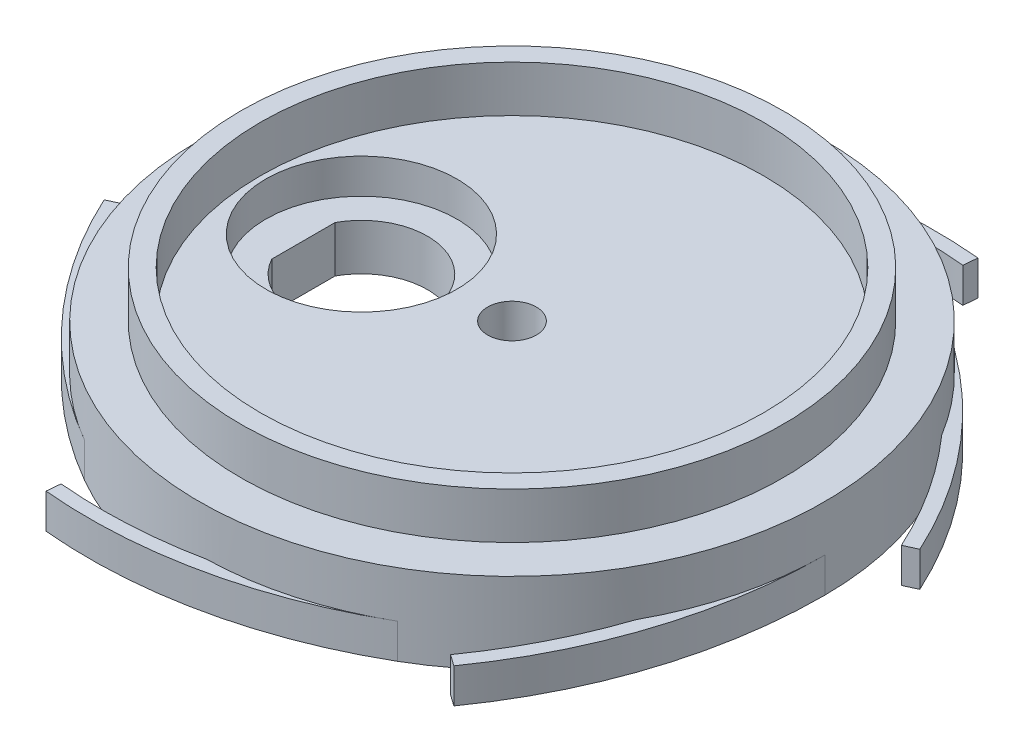
ISO-10303-21;
HEADER;
FILE_DESCRIPTION(('STEP AP214'),'2;1');
FILE_NAME('part.step','',(''),(''),'','','');
FILE_SCHEMA(('AUTOMOTIVE_DESIGN { 1 0 10303 214 1 1 1 1 }'));
ENDSEC;
DATA;
#1=APPLICATION_CONTEXT('core data for automotive mechanical design processes');
#2=APPLICATION_PROTOCOL_DEFINITION('international standard','automotive_design',2000,#1);
#3=PRODUCT_CONTEXT('',#1,'mechanical');
#4=PRODUCT('Part','Part','',(#3));
#5=PRODUCT_RELATED_PRODUCT_CATEGORY('part','',(#4));
#6=PRODUCT_DEFINITION_FORMATION('','',#4);
#7=PRODUCT_DEFINITION_CONTEXT('part definition',#1,'design');
#8=PRODUCT_DEFINITION('design','',#6,#7);
#9=PRODUCT_DEFINITION_SHAPE('','',#8);
#10=(LENGTH_UNIT() NAMED_UNIT(*) SI_UNIT(.MILLI.,.METRE.));
#11=(NAMED_UNIT(*) PLANE_ANGLE_UNIT() SI_UNIT($,.RADIAN.));
#12=(NAMED_UNIT(*) SI_UNIT($,.STERADIAN.) SOLID_ANGLE_UNIT());
#13=UNCERTAINTY_MEASURE_WITH_UNIT(LENGTH_MEASURE(1.E-05),#10,'distance_accuracy_value','');
#14=(GEOMETRIC_REPRESENTATION_CONTEXT(3) GLOBAL_UNCERTAINTY_ASSIGNED_CONTEXT((#13)) GLOBAL_UNIT_ASSIGNED_CONTEXT((#10,
#11,#12)) REPRESENTATION_CONTEXT('',''));
#15=CARTESIAN_POINT('',(0.,0.,0.));
#16=DIRECTION('',(0.,0.,1.));
#17=DIRECTION('',(1.,0.,0.));
#18=AXIS2_PLACEMENT_3D('',#15,#16,#17);
#19=CARTESIAN_POINT('',(-18.,-1.,0.));
#20=DIRECTION('',(-1.,0.,0.));
#21=DIRECTION('',(0.,-1.,0.));
#22=AXIS2_PLACEMENT_3D('',#19,#20,#21);
#23=PLANE('',#22);
#24=DIRECTION('',(0.,0.,-1.));
#25=VECTOR('',#24,1.);
#26=CARTESIAN_POINT('',(-18.,-7.,0.));
#27=LINE('',#26,#25);
#28=CARTESIAN_POINT('',(-18.,-7.,2.73678643668081));
#29=VERTEX_POINT('',#28);
#30=CARTESIAN_POINT('',(-18.,-7.,-2.73678643668081));
#31=VERTEX_POINT('',#30);
#32=EDGE_CURVE('E49',#29,#31,#27,.T.);
#33=ORIENTED_EDGE('',*,*,#32,.F.);
#34=DIRECTION('',(0.,-1.,0.));
#35=VECTOR('',#34,1.);
#36=CARTESIAN_POINT('',(-18.,-1.,2.73678643668081));
#37=LINE('',#36,#35);
#38=CARTESIAN_POINT('',(-18.,-11.,2.73678643668081));
#39=VERTEX_POINT('',#38);
#40=EDGE_CURVE('E209',#29,#39,#37,.T.);
#41=ORIENTED_EDGE('',*,*,#40,.T.);
#42=DIRECTION('',(0.,0.,-1.));
#43=VECTOR('',#42,1.);
#44=CARTESIAN_POINT('',(-18.,-11.,0.));
#45=LINE('',#44,#43);
#46=CARTESIAN_POINT('',(-18.,-11.,-2.73678643668081));
#47=VERTEX_POINT('',#46);
#48=EDGE_CURVE('E227',#39,#47,#45,.T.);
#49=ORIENTED_EDGE('',*,*,#48,.T.);
#50=DIRECTION('',(0.,-1.,0.));
#51=VECTOR('',#50,1.);
#52=CARTESIAN_POINT('',(-18.,-1.,-2.73678643668081));
#53=LINE('',#52,#51);
#54=EDGE_CURVE('E56',#31,#47,#53,.T.);
#55=ORIENTED_EDGE('',*,*,#54,.F.);
#56=EDGE_LOOP('',(#33,#41,#49,#55));
#57=FACE_BOUND('',#56,.T.);
#58=ADVANCED_FACE('F36',(#57),#23,.F.);
#59=CARTESIAN_POINT('',(-13.,-1.,0.));
#60=DIRECTION('',(0.,-1.,0.));
#61=DIRECTION('',(1.,0.,0.));
#62=AXIS2_PLACEMENT_3D('',#59,#60,#61);
#63=CYLINDRICAL_SURFACE('',#62,5.7);
#64=CARTESIAN_POINT('',(-13.,-7.,0.));
#65=DIRECTION('',(0.,1.,0.));
#66=DIRECTION('',(-1.,0.,0.));
#67=AXIS2_PLACEMENT_3D('',#64,#65,#66);
#68=CIRCLE('',#67,5.7);
#69=EDGE_CURVE('E11',#31,#29,#68,.F.);
#70=ORIENTED_EDGE('',*,*,#69,.F.);
#71=ORIENTED_EDGE('',*,*,#54,.T.);
#72=CARTESIAN_POINT('',(-13.,-11.,0.));
#73=DIRECTION('',(0.,-1.,0.));
#74=DIRECTION('',(1.,0.,0.));
#75=AXIS2_PLACEMENT_3D('',#72,#73,#74);
#76=CIRCLE('',#75,5.7);
#77=EDGE_CURVE('E215',#47,#39,#76,.T.);
#78=ORIENTED_EDGE('',*,*,#77,.T.);
#79=ORIENTED_EDGE('',*,*,#40,.F.);
#80=EDGE_LOOP('',(#70,#71,#78,#79));
#81=FACE_BOUND('',#80,.T.);
#82=ADVANCED_FACE('F213',(#81),#63,.F.);
#83=CARTESIAN_POINT('',(-21.7215004157586,0.,0.));
#84=DIRECTION('',(0.,1.,0.));
#85=DIRECTION('',(-1.,0.,0.));
#86=AXIS2_PLACEMENT_3D('',#83,#84,#85);
#87=PLANE('',#86);
#88=CARTESIAN_POINT('',(0.,0.,0.));
#89=DIRECTION('',(0.,1.,0.));
#90=DIRECTION('',(-1.,0.,0.));
#91=AXIS2_PLACEMENT_3D('',#88,#89,#90);
#92=CIRCLE('',#91,23.425);
#93=CARTESIAN_POINT('',(-23.425,0.,0.));
#94=VERTEX_POINT('',#93);
#95=EDGE_CURVE('E44',#94,#94,#92,.T.);
#96=ORIENTED_EDGE('',*,*,#95,.T.);
#97=EDGE_LOOP('',(#96));
#98=FACE_BOUND('',#97,.T.);
#99=CARTESIAN_POINT('',(0.,0.,0.));
#100=DIRECTION('',(0.,1.,0.));
#101=DIRECTION('',(-1.,0.,0.));
#102=AXIS2_PLACEMENT_3D('',#99,#100,#101);
#103=CIRCLE('',#102,21.7215004157586);
#104=CARTESIAN_POINT('',(-21.7215004157586,0.,0.));
#105=VERTEX_POINT('',#104);
#106=EDGE_CURVE('E393',#105,#105,#103,.T.);
#107=ORIENTED_EDGE('',*,*,#106,.F.);
#108=EDGE_LOOP('',(#107));
#109=FACE_BOUND('',#108,.T.);
#110=ADVANCED_FACE('F38',(#98,#109),#87,.T.);
#111=CARTESIAN_POINT('',(0.,-8.,0.));
#112=DIRECTION('',(0.,1.,0.));
#113=DIRECTION('',(-1.,0.,0.));
#114=AXIS2_PLACEMENT_3D('',#111,#112,#113);
#115=CYLINDRICAL_SURFACE('',#114,23.425);
#116=CARTESIAN_POINT('',(0.,-4.,0.));
#117=DIRECTION('',(0.,1.,0.));
#118=DIRECTION('',(-1.,0.,0.));
#119=AXIS2_PLACEMENT_3D('',#116,#117,#118);
#120=CIRCLE('',#119,23.425);
#121=CARTESIAN_POINT('',(-23.425,-4.,0.));
#122=VERTEX_POINT('',#121);
#123=EDGE_CURVE('E407',#122,#122,#120,.T.);
#124=ORIENTED_EDGE('',*,*,#123,.T.);
#125=EDGE_LOOP('',(#124));
#126=FACE_BOUND('',#125,.T.);
#127=ORIENTED_EDGE('',*,*,#95,.F.);
#128=EDGE_LOOP('',(#127));
#129=FACE_BOUND('',#128,.T.);
#130=ADVANCED_FACE('F414',(#126,#129),#115,.T.);
#131=CARTESIAN_POINT('',(-27.,-4.,0.));
#132=DIRECTION('',(0.,1.,0.));
#133=DIRECTION('',(-1.,0.,0.));
#134=AXIS2_PLACEMENT_3D('',#131,#132,#133);
#135=PLANE('',#134);
#136=CARTESIAN_POINT('',(0.,-4.,0.));
#137=DIRECTION('',(0.,1.,0.));
#138=DIRECTION('',(-1.,0.,0.));
#139=AXIS2_PLACEMENT_3D('',#136,#137,#138);
#140=CIRCLE('',#139,27.);
#141=CARTESIAN_POINT('',(-27.,-4.,0.));
#142=VERTEX_POINT('',#141);
#143=EDGE_CURVE('E404',#142,#142,#140,.T.);
#144=ORIENTED_EDGE('',*,*,#143,.T.);
#145=EDGE_LOOP('',(#144));
#146=FACE_BOUND('',#145,.T.);
#147=ORIENTED_EDGE('',*,*,#123,.F.);
#148=EDGE_LOOP('',(#147));
#149=FACE_BOUND('',#148,.T.);
#150=ADVANCED_FACE('F416',(#146,#149),#135,.T.);
#151=CARTESIAN_POINT('',(0.,-8.,0.));
#152=DIRECTION('',(0.,1.,0.));
#153=DIRECTION('',(-1.,0.,0.));
#154=AXIS2_PLACEMENT_3D('',#151,#152,#153);
#155=CYLINDRICAL_SURFACE('',#154,27.);
#156=CARTESIAN_POINT('',(0.,-8.,0.));
#157=DIRECTION('',(0.,1.,0.));
#158=DIRECTION('',(-1.,0.,0.));
#159=AXIS2_PLACEMENT_3D('',#156,#157,#158);
#160=CIRCLE('',#159,27.);
#161=CARTESIAN_POINT('',(-23.6880000000001,-8.,-12.9567996048405));
#162=VERTEX_POINT('',#161);
#163=CARTESIAN_POINT('',(-27.,-8.,1.88539992297529E-13));
#164=VERTEX_POINT('',#163);
#165=EDGE_CURVE('E399',#162,#164,#160,.T.);
#166=ORIENTED_EDGE('',*,*,#165,.T.);
#167=DIRECTION('',(0.,1.,0.));
#168=VECTOR('',#167,1.);
#169=CARTESIAN_POINT('',(-27.,-11.,1.83162676346973E-13));
#170=LINE('',#169,#168);
#171=CARTESIAN_POINT('',(-27.,-11.,1.83162676346973E-13));
#172=VERTEX_POINT('',#171);
#173=EDGE_CURVE('E356',#172,#164,#170,.T.);
#174=ORIENTED_EDGE('',*,*,#173,.F.);
#175=CARTESIAN_POINT('',(0.,-11.,0.));
#176=DIRECTION('',(0.,-1.,0.));
#177=DIRECTION('',(1.,0.,0.));
#178=AXIS2_PLACEMENT_3D('',#175,#176,#177);
#179=CIRCLE('',#178,27.);
#180=CARTESIAN_POINT('',(-23.0649176095361,-11.,14.0360099624257));
#181=VERTEX_POINT('',#180);
#182=EDGE_CURVE('E261',#181,#172,#179,.T.);
#183=ORIENTED_EDGE('',*,*,#182,.F.);
#184=DIRECTION('',(0.,1.,0.));
#185=VECTOR('',#184,1.);
#186=CARTESIAN_POINT('',(-23.0649176095361,-11.,14.0360099624257));
#187=LINE('',#186,#185);
#188=CARTESIAN_POINT('',(-23.0649176095361,-8.,14.0360099624257));
#189=VERTEX_POINT('',#188);
#190=EDGE_CURVE('E359',#181,#189,#187,.T.);
#191=ORIENTED_EDGE('',*,*,#190,.T.);
#192=CARTESIAN_POINT('',(-13.5000000000001,-8.,23.3826859021798));
#193=VERTEX_POINT('',#192);
#194=EDGE_CURVE('E403',#189,#193,#160,.T.);
#195=ORIENTED_EDGE('',*,*,#194,.T.);
#196=DIRECTION('',(0.,1.,0.));
#197=VECTOR('',#196,1.);
#198=CARTESIAN_POINT('',(-13.5000000000001,-11.,23.3826859021798));
#199=LINE('',#198,#197);
#200=CARTESIAN_POINT('',(-13.5000000000001,-11.,23.3826859021798));
#201=VERTEX_POINT('',#200);
#202=EDGE_CURVE('E368',#201,#193,#199,.T.);
#203=ORIENTED_EDGE('',*,*,#202,.F.);
#204=CARTESIAN_POINT('',(0.,-11.,0.));
#205=DIRECTION('',(0.,-1.,0.));
#206=DIRECTION('',(1.,0.,0.));
#207=AXIS2_PLACEMENT_3D('',#204,#205,#206);
#208=CIRCLE('',#207,27.);
#209=CARTESIAN_POINT('',(0.62308239046414,-11.,26.9928095672661));
#210=VERTEX_POINT('',#209);
#211=EDGE_CURVE('E253',#210,#201,#208,.T.);
#212=ORIENTED_EDGE('',*,*,#211,.F.);
#213=DIRECTION('',(0.,1.,0.));
#214=VECTOR('',#213,1.);
#215=CARTESIAN_POINT('',(0.62308239046414,-11.,26.9928095672661));
#216=LINE('',#215,#214);
#217=CARTESIAN_POINT('',(0.62308239046414,-8.,26.9928095672661));
#218=VERTEX_POINT('',#217);
#219=EDGE_CURVE('E370',#210,#218,#216,.T.);
#220=ORIENTED_EDGE('',*,*,#219,.T.);
#221=CARTESIAN_POINT('',(13.4999999999999,-8.,23.3826859021799));
#222=VERTEX_POINT('',#221);
#223=EDGE_CURVE('E560',#218,#222,#160,.T.);
#224=ORIENTED_EDGE('',*,*,#223,.T.);
#225=DIRECTION('',(0.,1.,0.));
#226=VECTOR('',#225,1.);
#227=CARTESIAN_POINT('',(13.4999999999999,-11.,23.3826859021799));
#228=LINE('',#227,#226);
#229=CARTESIAN_POINT('',(13.4999999999999,-11.,23.3826859021799));
#230=VERTEX_POINT('',#229);
#231=EDGE_CURVE('E379',#230,#222,#228,.T.);
#232=ORIENTED_EDGE('',*,*,#231,.F.);
#233=CARTESIAN_POINT('',(0.,-11.,0.));
#234=DIRECTION('',(0.,-1.,0.));
#235=DIRECTION('',(1.,0.,0.));
#236=AXIS2_PLACEMENT_3D('',#233,#234,#235);
#237=CIRCLE('',#236,27.);
#238=CARTESIAN_POINT('',(23.688,-11.,12.9567996048407));
#239=VERTEX_POINT('',#238);
#240=EDGE_CURVE('E245',#239,#230,#237,.T.);
#241=ORIENTED_EDGE('',*,*,#240,.F.);
#242=DIRECTION('',(0.,1.,0.));
#243=VECTOR('',#242,1.);
#244=CARTESIAN_POINT('',(23.688,-11.,12.9567996048407));
#245=LINE('',#244,#243);
#246=CARTESIAN_POINT('',(23.688,-8.,12.9567996048407));
#247=VERTEX_POINT('',#246);
#248=EDGE_CURVE('E381',#239,#247,#245,.T.);
#249=ORIENTED_EDGE('',*,*,#248,.T.);
#250=CARTESIAN_POINT('',(27.,-8.,-1.86517468137026E-13));
#251=VERTEX_POINT('',#250);
#252=EDGE_CURVE('E562',#247,#251,#160,.T.);
#253=ORIENTED_EDGE('',*,*,#252,.T.);
#254=DIRECTION('',(0.,1.,0.));
#255=VECTOR('',#254,1.);
#256=CARTESIAN_POINT('',(27.,-11.,-1.86517468137026E-13));
#257=LINE('',#256,#255);
#258=CARTESIAN_POINT('',(27.,-11.,-1.86517468137026E-13));
#259=VERTEX_POINT('',#258);
#260=EDGE_CURVE('E390',#259,#251,#257,.T.);
#261=ORIENTED_EDGE('',*,*,#260,.F.);
#262=CARTESIAN_POINT('',(0.,-11.,0.));
#263=DIRECTION('',(0.,-1.,0.));
#264=DIRECTION('',(1.,0.,0.));
#265=AXIS2_PLACEMENT_3D('',#262,#263,#264);
#266=CIRCLE('',#265,27.);
#267=CARTESIAN_POINT('',(23.0649176095362,-11.,-14.0360099624255));
#268=VERTEX_POINT('',#267);
#269=EDGE_CURVE('E235',#268,#259,#266,.T.);
#270=ORIENTED_EDGE('',*,*,#269,.F.);
#271=DIRECTION('',(0.,1.,0.));
#272=VECTOR('',#271,1.);
#273=CARTESIAN_POINT('',(23.0649176095362,-11.,-14.0360099624255));
#274=LINE('',#273,#272);
#275=CARTESIAN_POINT('',(23.0649176095362,-8.,-14.0360099624255));
#276=VERTEX_POINT('',#275);
#277=EDGE_CURVE('E285',#268,#276,#274,.T.);
#278=ORIENTED_EDGE('',*,*,#277,.T.);
#279=CARTESIAN_POINT('',(13.4999999999999,-8.,-23.3826859021799));
#280=VERTEX_POINT('',#279);
#281=EDGE_CURVE('E565',#276,#280,#160,.T.);
#282=ORIENTED_EDGE('',*,*,#281,.T.);
#283=DIRECTION('',(0.,1.,0.));
#284=VECTOR('',#283,1.);
#285=CARTESIAN_POINT('',(13.4999999999999,-11.,-23.3826859021799));
#286=LINE('',#285,#284);
#287=CARTESIAN_POINT('',(13.4999999999999,-11.,-23.3826859021799));
#288=VERTEX_POINT('',#287);
#289=EDGE_CURVE('E334',#288,#280,#286,.T.);
#290=ORIENTED_EDGE('',*,*,#289,.F.);
#291=CARTESIAN_POINT('',(0.,-11.,0.));
#292=DIRECTION('',(0.,-1.,0.));
#293=DIRECTION('',(1.,0.,0.));
#294=AXIS2_PLACEMENT_3D('',#291,#292,#293);
#295=CIRCLE('',#294,27.);
#296=CARTESIAN_POINT('',(-0.623082390463925,-11.,-26.9928095672661));
#297=VERTEX_POINT('',#296);
#298=EDGE_CURVE('E277',#297,#288,#295,.T.);
#299=ORIENTED_EDGE('',*,*,#298,.F.);
#300=DIRECTION('',(0.,1.,0.));
#301=VECTOR('',#300,1.);
#302=CARTESIAN_POINT('',(-0.623082390463925,-11.,-26.9928095672661));
#303=LINE('',#302,#301);
#304=CARTESIAN_POINT('',(-0.623082390463925,-8.,-26.9928095672661));
#305=VERTEX_POINT('',#304);
#306=EDGE_CURVE('E336',#297,#305,#303,.T.);
#307=ORIENTED_EDGE('',*,*,#306,.T.);
#308=CARTESIAN_POINT('',(-13.5000000000001,-8.,-23.3826859021798));
#309=VERTEX_POINT('',#308);
#310=EDGE_CURVE('E402',#305,#309,#160,.T.);
#311=ORIENTED_EDGE('',*,*,#310,.T.);
#312=DIRECTION('',(0.,1.,0.));
#313=VECTOR('',#312,1.);
#314=CARTESIAN_POINT('',(-13.5000000000001,-11.,-23.3826859021798));
#315=LINE('',#314,#313);
#316=CARTESIAN_POINT('',(-13.5000000000001,-11.,-23.3826859021798));
#317=VERTEX_POINT('',#316);
#318=EDGE_CURVE('E345',#317,#309,#315,.T.);
#319=ORIENTED_EDGE('',*,*,#318,.F.);
#320=CARTESIAN_POINT('',(0.,-11.,0.));
#321=DIRECTION('',(0.,-1.,0.));
#322=DIRECTION('',(1.,0.,0.));
#323=AXIS2_PLACEMENT_3D('',#320,#321,#322);
#324=CIRCLE('',#323,27.);
#325=CARTESIAN_POINT('',(-23.6880000000001,-11.,-12.9567996048405));
#326=VERTEX_POINT('',#325);
#327=EDGE_CURVE('E269',#326,#317,#324,.T.);
#328=ORIENTED_EDGE('',*,*,#327,.F.);
#329=DIRECTION('',(0.,1.,0.));
#330=VECTOR('',#329,1.);
#331=CARTESIAN_POINT('',(-23.6880000000001,-11.,-12.9567996048405));
#332=LINE('',#331,#330);
#333=EDGE_CURVE('E347',#326,#162,#332,.T.);
#334=ORIENTED_EDGE('',*,*,#333,.T.);
#335=EDGE_LOOP('',(#166,#174,#183,#191,#195,#203,#212,#220,#224,#232,#241,#249,#253,#261,#270,
#278,#282,#290,#299,#307,#311,#319,#328,#334));
#336=FACE_BOUND('',#335,.T.);
#337=ORIENTED_EDGE('',*,*,#143,.F.);
#338=EDGE_LOOP('',(#337));
#339=FACE_BOUND('',#338,.T.);
#340=ADVANCED_FACE('F422',(#336,#339),#155,.T.);
#341=CARTESIAN_POINT('',(-21.7215004157586,-4.,0.));
#342=DIRECTION('',(0.,1.,0.));
#343=DIRECTION('',(-1.,0.,0.));
#344=AXIS2_PLACEMENT_3D('',#341,#342,#343);
#345=PLANE('',#344);
#346=CARTESIAN_POINT('',(-13.,-4.,0.));
#347=DIRECTION('',(0.,1.,0.));
#348=DIRECTION('',(-1.,0.,0.));
#349=AXIS2_PLACEMENT_3D('',#346,#347,#348);
#350=CIRCLE('',#349,8.25);
#351=CARTESIAN_POINT('',(-21.25,-4.,0.));
#352=VERTEX_POINT('',#351);
#353=EDGE_CURVE('E869',#352,#352,#350,.T.);
#354=ORIENTED_EDGE('',*,*,#353,.F.);
#355=EDGE_LOOP('',(#354));
#356=FACE_BOUND('',#355,.T.);
#357=CARTESIAN_POINT('',(20.,-4.,0.));
#358=DIRECTION('',(0.,1.,0.));
#359=DIRECTION('',(-1.,0.,0.));
#360=AXIS2_PLACEMENT_3D('',#357,#358,#359);
#361=CIRCLE('',#360,1.);
#362=CARTESIAN_POINT('',(19.,-4.,0.));
#363=VERTEX_POINT('',#362);
#364=EDGE_CURVE('E217',#363,#363,#361,.T.);
#365=ORIENTED_EDGE('',*,*,#364,.F.);
#366=EDGE_LOOP('',(#365));
#367=FACE_BOUND('',#366,.T.);
#368=CARTESIAN_POINT('',(0.,-4.,0.));
#369=DIRECTION('',(0.,1.,0.));
#370=DIRECTION('',(0.,0.,1.));
#371=AXIS2_PLACEMENT_3D('',#368,#369,#370);
#372=CIRCLE('',#371,2.09999999999999);
#373=CARTESIAN_POINT('',(0.,-4.,2.09999999999999));
#374=VERTEX_POINT('',#373);
#375=EDGE_CURVE('E220',#374,#374,#372,.T.);
#376=ORIENTED_EDGE('',*,*,#375,.F.);
#377=EDGE_LOOP('',(#376));
#378=FACE_BOUND('',#377,.T.);
#379=CARTESIAN_POINT('',(0.,-4.,0.));
#380=DIRECTION('',(0.,1.,0.));
#381=DIRECTION('',(-1.,0.,0.));
#382=AXIS2_PLACEMENT_3D('',#379,#380,#381);
#383=CIRCLE('',#382,21.7215004157586);
#384=CARTESIAN_POINT('',(-21.7215004157586,-4.,0.));
#385=VERTEX_POINT('',#384);
#386=EDGE_CURVE('E396',#385,#385,#383,.T.);
#387=ORIENTED_EDGE('',*,*,#386,.T.);
#388=EDGE_LOOP('',(#387));
#389=FACE_BOUND('',#388,.T.);
#390=ADVANCED_FACE('F526',(#356,#367,#378,#389),#345,.T.);
#391=CARTESIAN_POINT('',(0.,-8.,0.));
#392=DIRECTION('',(0.,1.,0.));
#393=DIRECTION('',(-1.,0.,0.));
#394=AXIS2_PLACEMENT_3D('',#391,#392,#393);
#395=CYLINDRICAL_SURFACE('',#394,21.7215004157586);
#396=ORIENTED_EDGE('',*,*,#106,.T.);
#397=EDGE_LOOP('',(#396));
#398=FACE_BOUND('',#397,.T.);
#399=ORIENTED_EDGE('',*,*,#386,.F.);
#400=EDGE_LOOP('',(#399));
#401=FACE_BOUND('',#400,.T.);
#402=ADVANCED_FACE('F450',(#398,#401),#395,.F.);
#403=CARTESIAN_POINT('',(0.,-8.,0.));
#404=DIRECTION('',(0.,-1.,0.));
#405=DIRECTION('',(1.,0.,0.));
#406=AXIS2_PLACEMENT_3D('',#403,#404,#405);
#407=PLANE('',#406);
#408=ORIENTED_EDGE('',*,*,#194,.F.);
#409=CARTESIAN_POINT('',(7.49999999999988,-8.,-12.9903810567667));
#410=DIRECTION('',(0.,1.,0.));
#411=DIRECTION('',(1.,0.,0.));
#412=AXIS2_PLACEMENT_3D('',#409,#410,#411);
#413=CIRCLE('',#412,40.8);
#414=CARTESIAN_POINT('',(-29.574933173904,-8.,4.04162793074163));
#415=VERTEX_POINT('',#414);
#416=EDGE_CURVE('E303',#415,#189,#413,.T.);
#417=ORIENTED_EDGE('',*,*,#416,.F.);
#418=DIRECTION('',(0.908699342497644,0.,-0.417451200674222));
#419=VECTOR('',#418,1.);
#420=CARTESIAN_POINT('',(-29.574933173904,-8.,4.04162793074163));
#421=LINE('',#420,#419);
#422=CARTESIAN_POINT('',(-30.6653723849011,-8.,4.54256937155067));
#423=VERTEX_POINT('',#422);
#424=EDGE_CURVE('E301',#423,#415,#421,.T.);
#425=ORIENTED_EDGE('',*,*,#424,.F.);
#426=CARTESIAN_POINT('',(7.49999999999988,-8.,-12.9903810567667));
#427=DIRECTION('',(0.,-1.,0.));
#428=DIRECTION('',(1.,0.,0.));
#429=AXIS2_PLACEMENT_3D('',#426,#427,#428);
#430=CIRCLE('',#429,42.);
#431=EDGE_CURVE('E299',#193,#423,#430,.T.);
#432=ORIENTED_EDGE('',*,*,#431,.F.);
#433=EDGE_LOOP('',(#408,#417,#425,#432));
#434=FACE_BOUND('',#433,.T.);
#435=ADVANCED_FACE('F446',(#434),#407,.F.);
#436=ORIENTED_EDGE('',*,*,#223,.F.);
#437=CARTESIAN_POINT('',(-7.50000000000015,-8.,-12.9903810567665));
#438=DIRECTION('',(0.,1.,0.));
#439=DIRECTION('',(1.,0.,0.));
#440=AXIS2_PLACEMENT_3D('',#437,#438,#439);
#441=CIRCLE('',#440,40.8);
#442=CARTESIAN_POINT('',(-11.2873141262846,-8.,27.6334574091988));
#443=VERTEX_POINT('',#442);
#444=EDGE_CURVE('E296',#443,#218,#441,.T.);
#445=ORIENTED_EDGE('',*,*,#444,.F.);
#446=DIRECTION('',(0.0928263266246364,0.,-0.995682315342286));
#447=VECTOR('',#446,1.);
#448=CARTESIAN_POINT('',(-11.2873141262846,-8.,27.6334574091988));
#449=LINE('',#448,#447);
#450=CARTESIAN_POINT('',(-11.3987057182341,-8.,28.8282761876096));
#451=VERTEX_POINT('',#450);
#452=EDGE_CURVE('E294',#451,#443,#449,.T.);
#453=ORIENTED_EDGE('',*,*,#452,.F.);
#454=CARTESIAN_POINT('',(-7.50000000000015,-8.,-12.9903810567665));
#455=DIRECTION('',(0.,-1.,0.));
#456=DIRECTION('',(1.,0.,0.));
#457=AXIS2_PLACEMENT_3D('',#454,#455,#456);
#458=CIRCLE('',#457,42.);
#459=EDGE_CURVE('E292',#222,#451,#458,.T.);
#460=ORIENTED_EDGE('',*,*,#459,.F.);
#461=EDGE_LOOP('',(#436,#445,#453,#460));
#462=FACE_BOUND('',#461,.T.);
#463=ADVANCED_FACE('F449',(#462),#407,.F.);
#464=ORIENTED_EDGE('',*,*,#252,.F.);
#465=CARTESIAN_POINT('',(-15.,-8.,0.));
#466=DIRECTION('',(0.,1.,0.));
#467=DIRECTION('',(1.,0.,0.));
#468=AXIS2_PLACEMENT_3D('',#465,#466,#467);
#469=CIRCLE('',#468,40.8);
#470=CARTESIAN_POINT('',(18.287619047619,-8.,23.5918294784569));
#471=VERTEX_POINT('',#470);
#472=EDGE_CURVE('E289',#471,#247,#469,.T.);
#473=ORIENTED_EDGE('',*,*,#472,.F.);
#474=DIRECTION('',(-0.815873015873016,0.,-0.578231114668062));
#475=VECTOR('',#474,1.);
#476=CARTESIAN_POINT('',(18.287619047619,-8.,23.5918294784569));
#477=LINE('',#476,#475);
#478=CARTESIAN_POINT('',(19.2666666666667,-8.,24.2857068160586));
#479=VERTEX_POINT('',#478);
#480=EDGE_CURVE('E287',#479,#471,#477,.T.);
#481=ORIENTED_EDGE('',*,*,#480,.F.);
#482=CARTESIAN_POINT('',(-15.,-8.,0.));
#483=DIRECTION('',(0.,-1.,0.));
#484=DIRECTION('',(1.,0.,0.));
#485=AXIS2_PLACEMENT_3D('',#482,#483,#484);
#486=CIRCLE('',#485,42.);
#487=EDGE_CURVE('E234',#251,#479,#486,.T.);
#488=ORIENTED_EDGE('',*,*,#487,.F.);
#489=EDGE_LOOP('',(#464,#473,#481,#488));
#490=FACE_BOUND('',#489,.T.);
#491=ADVANCED_FACE('F616',(#490),#407,.F.);
#492=ORIENTED_EDGE('',*,*,#281,.F.);
#493=CARTESIAN_POINT('',(-7.49999999999997,-8.,12.9903810567666));
#494=DIRECTION('',(0.,1.,0.));
#495=DIRECTION('',(1.,0.,0.));
#496=AXIS2_PLACEMENT_3D('',#493,#494,#495);
#497=CIRCLE('',#496,40.8);
#498=CARTESIAN_POINT('',(29.5749331739038,-8.,-4.04162793074188));
#499=VERTEX_POINT('',#498);
#500=EDGE_CURVE('E239',#499,#276,#497,.T.);
#501=ORIENTED_EDGE('',*,*,#500,.F.);
#502=DIRECTION('',(-0.908699342497644,0.,0.417451200674223));
#503=VECTOR('',#502,1.);
#504=CARTESIAN_POINT('',(29.5749331739038,-8.,-4.04162793074188));
#505=LINE('',#504,#503);
#506=CARTESIAN_POINT('',(30.665372384901,-8.,-4.54256937155094));
#507=VERTEX_POINT('',#506);
#508=EDGE_CURVE('E322',#507,#499,#505,.T.);
#509=ORIENTED_EDGE('',*,*,#508,.F.);
#510=CARTESIAN_POINT('',(-7.49999999999997,-8.,12.9903810567666));
#511=DIRECTION('',(0.,-1.,0.));
#512=DIRECTION('',(1.,0.,0.));
#513=AXIS2_PLACEMENT_3D('',#510,#511,#512);
#514=CIRCLE('',#513,42.);
#515=EDGE_CURVE('E320',#280,#507,#514,.T.);
#516=ORIENTED_EDGE('',*,*,#515,.F.);
#517=EDGE_LOOP('',(#492,#501,#509,#516));
#518=FACE_BOUND('',#517,.T.);
#519=ADVANCED_FACE('F620',(#518),#407,.F.);
#520=ORIENTED_EDGE('',*,*,#310,.F.);
#521=CARTESIAN_POINT('',(7.50000000000006,-8.,12.9903810567665));
#522=DIRECTION('',(0.,1.,0.));
#523=DIRECTION('',(1.,0.,0.));
#524=AXIS2_PLACEMENT_3D('',#521,#522,#523);
#525=CIRCLE('',#524,40.8);
#526=CARTESIAN_POINT('',(11.2873141262846,-8.,-27.6334574091988));
#527=VERTEX_POINT('',#526);
#528=EDGE_CURVE('E317',#527,#305,#525,.T.);
#529=ORIENTED_EDGE('',*,*,#528,.F.);
#530=DIRECTION('',(-0.092826326624627,0.,0.995682315342287));
#531=VECTOR('',#530,1.);
#532=CARTESIAN_POINT('',(11.2873141262846,-8.,-27.6334574091988));
#533=LINE('',#532,#531);
#534=CARTESIAN_POINT('',(11.3987057182342,-8.,-28.8282761876096));
#535=VERTEX_POINT('',#534);
#536=EDGE_CURVE('E315',#535,#527,#533,.T.);
#537=ORIENTED_EDGE('',*,*,#536,.F.);
#538=CARTESIAN_POINT('',(7.50000000000006,-8.,12.9903810567665));
#539=DIRECTION('',(0.,-1.,0.));
#540=DIRECTION('',(1.,0.,0.));
#541=AXIS2_PLACEMENT_3D('',#538,#539,#540);
#542=CIRCLE('',#541,42.);
#543=EDGE_CURVE('E313',#309,#535,#542,.T.);
#544=ORIENTED_EDGE('',*,*,#543,.F.);
#545=EDGE_LOOP('',(#520,#529,#537,#544));
#546=FACE_BOUND('',#545,.T.);
#547=ADVANCED_FACE('F577',(#546),#407,.F.);
#548=ORIENTED_EDGE('',*,*,#165,.F.);
#549=CARTESIAN_POINT('',(15.,-8.,-1.04744440165294E-13));
#550=DIRECTION('',(0.,1.,0.));
#551=DIRECTION('',(1.,0.,0.));
#552=AXIS2_PLACEMENT_3D('',#549,#550,#551);
#553=CIRCLE('',#552,40.8);
#554=CARTESIAN_POINT('',(-18.2876190476192,-8.,-23.5918294784568));
#555=VERTEX_POINT('',#554);
#556=EDGE_CURVE('E310',#555,#162,#553,.T.);
#557=ORIENTED_EDGE('',*,*,#556,.F.);
#558=DIRECTION('',(0.815873015873018,0.,0.578231114668059));
#559=VECTOR('',#558,1.);
#560=CARTESIAN_POINT('',(-18.2876190476192,-8.,-23.5918294784568));
#561=LINE('',#560,#559);
#562=CARTESIAN_POINT('',(-19.2666666666668,-8.,-24.2857068160585));
#563=VERTEX_POINT('',#562);
#564=EDGE_CURVE('E308',#563,#555,#561,.T.);
#565=ORIENTED_EDGE('',*,*,#564,.F.);
#566=CARTESIAN_POINT('',(15.,-8.,-1.04744440165294E-13));
#567=DIRECTION('',(0.,-1.,0.));
#568=DIRECTION('',(1.,0.,0.));
#569=AXIS2_PLACEMENT_3D('',#566,#567,#568);
#570=CIRCLE('',#569,42.);
#571=EDGE_CURVE('E306',#164,#563,#570,.T.);
#572=ORIENTED_EDGE('',*,*,#571,.F.);
#573=EDGE_LOOP('',(#548,#557,#565,#572));
#574=FACE_BOUND('',#573,.T.);
#575=ADVANCED_FACE('F452',(#574),#407,.F.);
#576=CARTESIAN_POINT('',(-15.,-11.,0.));
#577=DIRECTION('',(0.,1.,0.));
#578=DIRECTION('',(-1.,0.,0.));
#579=AXIS2_PLACEMENT_3D('',#576,#577,#578);
#580=CYLINDRICAL_SURFACE('',#579,42.);
#581=ORIENTED_EDGE('',*,*,#487,.T.);
#582=DIRECTION('',(0.,1.,0.));
#583=VECTOR('',#582,1.);
#584=CARTESIAN_POINT('',(19.2666666666667,-11.,24.2857068160586));
#585=LINE('',#584,#583);
#586=CARTESIAN_POINT('',(19.2666666666667,-11.,24.2857068160586));
#587=VERTEX_POINT('',#586);
#588=EDGE_CURVE('E387',#587,#479,#585,.T.);
#589=ORIENTED_EDGE('',*,*,#588,.F.);
#590=CARTESIAN_POINT('',(-15.,-11.,0.));
#591=DIRECTION('',(0.,-1.,0.));
#592=DIRECTION('',(1.,0.,0.));
#593=AXIS2_PLACEMENT_3D('',#590,#591,#592);
#594=CIRCLE('',#593,42.);
#595=EDGE_CURVE('E238',#259,#587,#594,.T.);
#596=ORIENTED_EDGE('',*,*,#595,.F.);
#597=ORIENTED_EDGE('',*,*,#260,.T.);
#598=EDGE_LOOP('',(#581,#589,#596,#597));
#599=FACE_BOUND('',#598,.T.);
#600=ADVANCED_FACE('F519',(#599),#580,.T.);
#601=CARTESIAN_POINT('',(18.287619047619,-11.,23.5918294784569));
#602=DIRECTION('',(0.578231114668062,0.,-0.815873015873016));
#603=DIRECTION('',(-0.815873015873016,0.,-0.578231114668062));
#604=AXIS2_PLACEMENT_3D('',#601,#602,#603);
#605=PLANE('',#604);
#606=ORIENTED_EDGE('',*,*,#480,.T.);
#607=DIRECTION('',(0.,1.,0.));
#608=VECTOR('',#607,1.);
#609=CARTESIAN_POINT('',(18.287619047619,-11.,23.5918294784569));
#610=LINE('',#609,#608);
#611=CARTESIAN_POINT('',(18.287619047619,-11.,23.5918294784569));
#612=VERTEX_POINT('',#611);
#613=EDGE_CURVE('E384',#612,#471,#610,.T.);
#614=ORIENTED_EDGE('',*,*,#613,.F.);
#615=DIRECTION('',(-0.815873015873016,0.,-0.578231114668062));
#616=VECTOR('',#615,1.);
#617=CARTESIAN_POINT('',(18.287619047619,-11.,23.5918294784569));
#618=LINE('',#617,#616);
#619=EDGE_CURVE('E241',#587,#612,#618,.T.);
#620=ORIENTED_EDGE('',*,*,#619,.F.);
#621=ORIENTED_EDGE('',*,*,#588,.T.);
#622=EDGE_LOOP('',(#606,#614,#620,#621));
#623=FACE_BOUND('',#622,.T.);
#624=ADVANCED_FACE('F515',(#623),#605,.F.);
#625=CARTESIAN_POINT('',(-15.,-11.,0.));
#626=DIRECTION('',(0.,1.,0.));
#627=DIRECTION('',(-1.,0.,0.));
#628=AXIS2_PLACEMENT_3D('',#625,#626,#627);
#629=CYLINDRICAL_SURFACE('',#628,40.8);
#630=ORIENTED_EDGE('',*,*,#472,.T.);
#631=ORIENTED_EDGE('',*,*,#248,.F.);
#632=CARTESIAN_POINT('',(-15.,-11.,0.));
#633=DIRECTION('',(0.,1.,0.));
#634=DIRECTION('',(1.,0.,0.));
#635=AXIS2_PLACEMENT_3D('',#632,#633,#634);
#636=CIRCLE('',#635,40.8);
#637=EDGE_CURVE('E243',#612,#239,#636,.T.);
#638=ORIENTED_EDGE('',*,*,#637,.F.);
#639=ORIENTED_EDGE('',*,*,#613,.T.);
#640=EDGE_LOOP('',(#630,#631,#638,#639));
#641=FACE_BOUND('',#640,.T.);
#642=ADVANCED_FACE('F511',(#641),#629,.F.);
#643=CARTESIAN_POINT('',(-7.50000000000015,-11.,-12.9903810567665));
#644=DIRECTION('',(0.,1.,0.));
#645=DIRECTION('',(-1.,0.,0.));
#646=AXIS2_PLACEMENT_3D('',#643,#644,#645);
#647=CYLINDRICAL_SURFACE('',#646,42.);
#648=ORIENTED_EDGE('',*,*,#459,.T.);
#649=DIRECTION('',(0.,1.,0.));
#650=VECTOR('',#649,1.);
#651=CARTESIAN_POINT('',(-11.3987057182341,-11.,28.8282761876096));
#652=LINE('',#651,#650);
#653=CARTESIAN_POINT('',(-11.3987057182341,-11.,28.8282761876096));
#654=VERTEX_POINT('',#653);
#655=EDGE_CURVE('E376',#654,#451,#652,.T.);
#656=ORIENTED_EDGE('',*,*,#655,.F.);
#657=CARTESIAN_POINT('',(-7.50000000000015,-11.,-12.9903810567665));
#658=DIRECTION('',(0.,-1.,0.));
#659=DIRECTION('',(1.,0.,0.));
#660=AXIS2_PLACEMENT_3D('',#657,#658,#659);
#661=CIRCLE('',#660,42.);
#662=EDGE_CURVE('E247',#230,#654,#661,.T.);
#663=ORIENTED_EDGE('',*,*,#662,.F.);
#664=ORIENTED_EDGE('',*,*,#231,.T.);
#665=EDGE_LOOP('',(#648,#656,#663,#664));
#666=FACE_BOUND('',#665,.T.);
#667=ADVANCED_FACE('F507',(#666),#647,.T.);
#668=CARTESIAN_POINT('',(-11.2873141262846,-11.,27.6334574091988));
#669=DIRECTION('',(0.995682315342286,0.,0.0928263266246364));
#670=DIRECTION('',(0.0928263266246364,0.,-0.995682315342286));
#671=AXIS2_PLACEMENT_3D('',#668,#669,#670);
#672=PLANE('',#671);
#673=ORIENTED_EDGE('',*,*,#452,.T.);
#674=DIRECTION('',(0.,1.,0.));
#675=VECTOR('',#674,1.);
#676=CARTESIAN_POINT('',(-11.2873141262846,-11.,27.6334574091988));
#677=LINE('',#676,#675);
#678=CARTESIAN_POINT('',(-11.2873141262846,-11.,27.6334574091988));
#679=VERTEX_POINT('',#678);
#680=EDGE_CURVE('E373',#679,#443,#677,.T.);
#681=ORIENTED_EDGE('',*,*,#680,.F.);
#682=DIRECTION('',(0.0928263266246364,0.,-0.995682315342286));
#683=VECTOR('',#682,1.);
#684=CARTESIAN_POINT('',(-11.2873141262846,-11.,27.6334574091988));
#685=LINE('',#684,#683);
#686=EDGE_CURVE('E249',#654,#679,#685,.T.);
#687=ORIENTED_EDGE('',*,*,#686,.F.);
#688=ORIENTED_EDGE('',*,*,#655,.T.);
#689=EDGE_LOOP('',(#673,#681,#687,#688));
#690=FACE_BOUND('',#689,.T.);
#691=ADVANCED_FACE('F503',(#690),#672,.F.);
#692=CARTESIAN_POINT('',(-7.50000000000015,-11.,-12.9903810567665));
#693=DIRECTION('',(0.,1.,0.));
#694=DIRECTION('',(-1.,0.,0.));
#695=AXIS2_PLACEMENT_3D('',#692,#693,#694);
#696=CYLINDRICAL_SURFACE('',#695,40.8);
#697=ORIENTED_EDGE('',*,*,#444,.T.);
#698=ORIENTED_EDGE('',*,*,#219,.F.);
#699=CARTESIAN_POINT('',(-7.50000000000015,-11.,-12.9903810567665));
#700=DIRECTION('',(0.,1.,0.));
#701=DIRECTION('',(1.,0.,0.));
#702=AXIS2_PLACEMENT_3D('',#699,#700,#701);
#703=CIRCLE('',#702,40.8);
#704=EDGE_CURVE('E251',#679,#210,#703,.T.);
#705=ORIENTED_EDGE('',*,*,#704,.F.);
#706=ORIENTED_EDGE('',*,*,#680,.T.);
#707=EDGE_LOOP('',(#697,#698,#705,#706));
#708=FACE_BOUND('',#707,.T.);
#709=ADVANCED_FACE('F499',(#708),#696,.F.);
#710=CARTESIAN_POINT('',(7.49999999999988,-11.,-12.9903810567667));
#711=DIRECTION('',(0.,1.,0.));
#712=DIRECTION('',(-1.,0.,0.));
#713=AXIS2_PLACEMENT_3D('',#710,#711,#712);
#714=CYLINDRICAL_SURFACE('',#713,42.);
#715=ORIENTED_EDGE('',*,*,#431,.T.);
#716=DIRECTION('',(0.,1.,0.));
#717=VECTOR('',#716,1.);
#718=CARTESIAN_POINT('',(-30.6653723849011,-11.,4.54256937155067));
#719=LINE('',#718,#717);
#720=CARTESIAN_POINT('',(-30.6653723849011,-11.,4.54256937155067));
#721=VERTEX_POINT('',#720);
#722=EDGE_CURVE('E365',#721,#423,#719,.T.);
#723=ORIENTED_EDGE('',*,*,#722,.F.);
#724=CARTESIAN_POINT('',(7.49999999999988,-11.,-12.9903810567667));
#725=DIRECTION('',(0.,-1.,0.));
#726=DIRECTION('',(1.,0.,0.));
#727=AXIS2_PLACEMENT_3D('',#724,#725,#726);
#728=CIRCLE('',#727,42.);
#729=EDGE_CURVE('E255',#201,#721,#728,.T.);
#730=ORIENTED_EDGE('',*,*,#729,.F.);
#731=ORIENTED_EDGE('',*,*,#202,.T.);
#732=EDGE_LOOP('',(#715,#723,#730,#731));
#733=FACE_BOUND('',#732,.T.);
#734=ADVANCED_FACE('F495',(#733),#714,.T.);
#735=CARTESIAN_POINT('',(-29.574933173904,-11.,4.04162793074163));
#736=DIRECTION('',(0.417451200674222,0.,0.908699342497644));
#737=DIRECTION('',(0.908699342497644,0.,-0.417451200674222));
#738=AXIS2_PLACEMENT_3D('',#735,#736,#737);
#739=PLANE('',#738);
#740=ORIENTED_EDGE('',*,*,#424,.T.);
#741=DIRECTION('',(0.,1.,0.));
#742=VECTOR('',#741,1.);
#743=CARTESIAN_POINT('',(-29.574933173904,-11.,4.04162793074163));
#744=LINE('',#743,#742);
#745=CARTESIAN_POINT('',(-29.574933173904,-11.,4.04162793074163));
#746=VERTEX_POINT('',#745);
#747=EDGE_CURVE('E362',#746,#415,#744,.T.);
#748=ORIENTED_EDGE('',*,*,#747,.F.);
#749=DIRECTION('',(0.908699342497644,0.,-0.417451200674222));
#750=VECTOR('',#749,1.);
#751=CARTESIAN_POINT('',(-29.574933173904,-11.,4.04162793074163));
#752=LINE('',#751,#750);
#753=EDGE_CURVE('E257',#721,#746,#752,.T.);
#754=ORIENTED_EDGE('',*,*,#753,.F.);
#755=ORIENTED_EDGE('',*,*,#722,.T.);
#756=EDGE_LOOP('',(#740,#748,#754,#755));
#757=FACE_BOUND('',#756,.T.);
#758=ADVANCED_FACE('F491',(#757),#739,.F.);
#759=CARTESIAN_POINT('',(7.49999999999988,-11.,-12.9903810567667));
#760=DIRECTION('',(0.,1.,0.));
#761=DIRECTION('',(-1.,0.,0.));
#762=AXIS2_PLACEMENT_3D('',#759,#760,#761);
#763=CYLINDRICAL_SURFACE('',#762,40.8);
#764=ORIENTED_EDGE('',*,*,#416,.T.);
#765=ORIENTED_EDGE('',*,*,#190,.F.);
#766=CARTESIAN_POINT('',(7.49999999999988,-11.,-12.9903810567667));
#767=DIRECTION('',(0.,1.,0.));
#768=DIRECTION('',(1.,0.,0.));
#769=AXIS2_PLACEMENT_3D('',#766,#767,#768);
#770=CIRCLE('',#769,40.8);
#771=EDGE_CURVE('E259',#746,#181,#770,.T.);
#772=ORIENTED_EDGE('',*,*,#771,.F.);
#773=ORIENTED_EDGE('',*,*,#747,.T.);
#774=EDGE_LOOP('',(#764,#765,#772,#773));
#775=FACE_BOUND('',#774,.T.);
#776=ADVANCED_FACE('F487',(#775),#763,.F.);
#777=CARTESIAN_POINT('',(15.,-11.,-1.04744440165294E-13));
#778=DIRECTION('',(0.,1.,0.));
#779=DIRECTION('',(-1.,0.,0.));
#780=AXIS2_PLACEMENT_3D('',#777,#778,#779);
#781=CYLINDRICAL_SURFACE('',#780,42.);
#782=ORIENTED_EDGE('',*,*,#571,.T.);
#783=DIRECTION('',(0.,1.,0.));
#784=VECTOR('',#783,1.);
#785=CARTESIAN_POINT('',(-19.2666666666668,-11.,-24.2857068160585));
#786=LINE('',#785,#784);
#787=CARTESIAN_POINT('',(-19.2666666666668,-11.,-24.2857068160585));
#788=VERTEX_POINT('',#787);
#789=EDGE_CURVE('E353',#788,#563,#786,.T.);
#790=ORIENTED_EDGE('',*,*,#789,.F.);
#791=CARTESIAN_POINT('',(15.,-11.,-1.04744440165294E-13));
#792=DIRECTION('',(0.,-1.,0.));
#793=DIRECTION('',(1.,0.,0.));
#794=AXIS2_PLACEMENT_3D('',#791,#792,#793);
#795=CIRCLE('',#794,42.);
#796=EDGE_CURVE('E263',#172,#788,#795,.T.);
#797=ORIENTED_EDGE('',*,*,#796,.F.);
#798=ORIENTED_EDGE('',*,*,#173,.T.);
#799=EDGE_LOOP('',(#782,#790,#797,#798));
#800=FACE_BOUND('',#799,.T.);
#801=ADVANCED_FACE('F483',(#800),#781,.T.);
#802=CARTESIAN_POINT('',(-18.2876190476192,-11.,-23.5918294784568));
#803=DIRECTION('',(-0.578231114668059,0.,0.815873015873018));
#804=DIRECTION('',(0.815873015873018,0.,0.578231114668059));
#805=AXIS2_PLACEMENT_3D('',#802,#803,#804);
#806=PLANE('',#805);
#807=ORIENTED_EDGE('',*,*,#564,.T.);
#808=DIRECTION('',(0.,1.,0.));
#809=VECTOR('',#808,1.);
#810=CARTESIAN_POINT('',(-18.2876190476192,-11.,-23.5918294784568));
#811=LINE('',#810,#809);
#812=CARTESIAN_POINT('',(-18.2876190476192,-11.,-23.5918294784568));
#813=VERTEX_POINT('',#812);
#814=EDGE_CURVE('E350',#813,#555,#811,.T.);
#815=ORIENTED_EDGE('',*,*,#814,.F.);
#816=DIRECTION('',(0.815873015873018,0.,0.578231114668059));
#817=VECTOR('',#816,1.);
#818=CARTESIAN_POINT('',(-18.2876190476192,-11.,-23.5918294784568));
#819=LINE('',#818,#817);
#820=EDGE_CURVE('E265',#788,#813,#819,.T.);
#821=ORIENTED_EDGE('',*,*,#820,.F.);
#822=ORIENTED_EDGE('',*,*,#789,.T.);
#823=EDGE_LOOP('',(#807,#815,#821,#822));
#824=FACE_BOUND('',#823,.T.);
#825=ADVANCED_FACE('F479',(#824),#806,.F.);
#826=CARTESIAN_POINT('',(15.,-11.,-1.04744440165294E-13));
#827=DIRECTION('',(0.,1.,0.));
#828=DIRECTION('',(-1.,0.,0.));
#829=AXIS2_PLACEMENT_3D('',#826,#827,#828);
#830=CYLINDRICAL_SURFACE('',#829,40.8);
#831=ORIENTED_EDGE('',*,*,#556,.T.);
#832=ORIENTED_EDGE('',*,*,#333,.F.);
#833=CARTESIAN_POINT('',(15.,-11.,-1.04744440165294E-13));
#834=DIRECTION('',(0.,1.,0.));
#835=DIRECTION('',(1.,0.,0.));
#836=AXIS2_PLACEMENT_3D('',#833,#834,#835);
#837=CIRCLE('',#836,40.8);
#838=EDGE_CURVE('E267',#813,#326,#837,.T.);
#839=ORIENTED_EDGE('',*,*,#838,.F.);
#840=ORIENTED_EDGE('',*,*,#814,.T.);
#841=EDGE_LOOP('',(#831,#832,#839,#840));
#842=FACE_BOUND('',#841,.T.);
#843=ADVANCED_FACE('F475',(#842),#830,.F.);
#844=CARTESIAN_POINT('',(7.50000000000006,-11.,12.9903810567665));
#845=DIRECTION('',(0.,1.,0.));
#846=DIRECTION('',(-1.,0.,0.));
#847=AXIS2_PLACEMENT_3D('',#844,#845,#846);
#848=CYLINDRICAL_SURFACE('',#847,42.);
#849=ORIENTED_EDGE('',*,*,#543,.T.);
#850=DIRECTION('',(0.,1.,0.));
#851=VECTOR('',#850,1.);
#852=CARTESIAN_POINT('',(11.3987057182342,-11.,-28.8282761876096));
#853=LINE('',#852,#851);
#854=CARTESIAN_POINT('',(11.3987057182342,-11.,-28.8282761876096));
#855=VERTEX_POINT('',#854);
#856=EDGE_CURVE('E342',#855,#535,#853,.T.);
#857=ORIENTED_EDGE('',*,*,#856,.F.);
#858=CARTESIAN_POINT('',(7.50000000000006,-11.,12.9903810567665));
#859=DIRECTION('',(0.,-1.,0.));
#860=DIRECTION('',(1.,0.,0.));
#861=AXIS2_PLACEMENT_3D('',#858,#859,#860);
#862=CIRCLE('',#861,42.);
#863=EDGE_CURVE('E271',#317,#855,#862,.T.);
#864=ORIENTED_EDGE('',*,*,#863,.F.);
#865=ORIENTED_EDGE('',*,*,#318,.T.);
#866=EDGE_LOOP('',(#849,#857,#864,#865));
#867=FACE_BOUND('',#866,.T.);
#868=ADVANCED_FACE('F471',(#867),#848,.T.);
#869=CARTESIAN_POINT('',(11.2873141262846,-11.,-27.6334574091988));
#870=DIRECTION('',(-0.995682315342287,0.,-0.092826326624627));
#871=DIRECTION('',(-0.092826326624627,0.,0.995682315342287));
#872=AXIS2_PLACEMENT_3D('',#869,#870,#871);
#873=PLANE('',#872);
#874=ORIENTED_EDGE('',*,*,#536,.T.);
#875=DIRECTION('',(0.,1.,0.));
#876=VECTOR('',#875,1.);
#877=CARTESIAN_POINT('',(11.2873141262846,-11.,-27.6334574091988));
#878=LINE('',#877,#876);
#879=CARTESIAN_POINT('',(11.2873141262846,-11.,-27.6334574091988));
#880=VERTEX_POINT('',#879);
#881=EDGE_CURVE('E339',#880,#527,#878,.T.);
#882=ORIENTED_EDGE('',*,*,#881,.F.);
#883=DIRECTION('',(-0.092826326624627,0.,0.995682315342287));
#884=VECTOR('',#883,1.);
#885=CARTESIAN_POINT('',(11.2873141262846,-11.,-27.6334574091988));
#886=LINE('',#885,#884);
#887=EDGE_CURVE('E273',#855,#880,#886,.T.);
#888=ORIENTED_EDGE('',*,*,#887,.F.);
#889=ORIENTED_EDGE('',*,*,#856,.T.);
#890=EDGE_LOOP('',(#874,#882,#888,#889));
#891=FACE_BOUND('',#890,.T.);
#892=ADVANCED_FACE('F467',(#891),#873,.F.);
#893=CARTESIAN_POINT('',(7.50000000000006,-11.,12.9903810567665));
#894=DIRECTION('',(0.,1.,0.));
#895=DIRECTION('',(-1.,0.,0.));
#896=AXIS2_PLACEMENT_3D('',#893,#894,#895);
#897=CYLINDRICAL_SURFACE('',#896,40.8);
#898=ORIENTED_EDGE('',*,*,#528,.T.);
#899=ORIENTED_EDGE('',*,*,#306,.F.);
#900=CARTESIAN_POINT('',(7.50000000000006,-11.,12.9903810567665));
#901=DIRECTION('',(0.,1.,0.));
#902=DIRECTION('',(1.,0.,0.));
#903=AXIS2_PLACEMENT_3D('',#900,#901,#902);
#904=CIRCLE('',#903,40.8);
#905=EDGE_CURVE('E275',#880,#297,#904,.T.);
#906=ORIENTED_EDGE('',*,*,#905,.F.);
#907=ORIENTED_EDGE('',*,*,#881,.T.);
#908=EDGE_LOOP('',(#898,#899,#906,#907));
#909=FACE_BOUND('',#908,.T.);
#910=ADVANCED_FACE('F463',(#909),#897,.F.);
#911=CARTESIAN_POINT('',(-7.49999999999997,-11.,12.9903810567666));
#912=DIRECTION('',(0.,1.,0.));
#913=DIRECTION('',(-1.,0.,0.));
#914=AXIS2_PLACEMENT_3D('',#911,#912,#913);
#915=CYLINDRICAL_SURFACE('',#914,42.);
#916=ORIENTED_EDGE('',*,*,#515,.T.);
#917=DIRECTION('',(0.,1.,0.));
#918=VECTOR('',#917,1.);
#919=CARTESIAN_POINT('',(30.665372384901,-11.,-4.54256937155094));
#920=LINE('',#919,#918);
#921=CARTESIAN_POINT('',(30.665372384901,-11.,-4.54256937155094));
#922=VERTEX_POINT('',#921);
#923=EDGE_CURVE('E331',#922,#507,#920,.T.);
#924=ORIENTED_EDGE('',*,*,#923,.F.);
#925=CARTESIAN_POINT('',(-7.49999999999997,-11.,12.9903810567666));
#926=DIRECTION('',(0.,-1.,0.));
#927=DIRECTION('',(1.,0.,0.));
#928=AXIS2_PLACEMENT_3D('',#925,#926,#927);
#929=CIRCLE('',#928,42.);
#930=EDGE_CURVE('E279',#288,#922,#929,.T.);
#931=ORIENTED_EDGE('',*,*,#930,.F.);
#932=ORIENTED_EDGE('',*,*,#289,.T.);
#933=EDGE_LOOP('',(#916,#924,#931,#932));
#934=FACE_BOUND('',#933,.T.);
#935=ADVANCED_FACE('F459',(#934),#915,.T.);
#936=CARTESIAN_POINT('',(29.5749331739038,-11.,-4.04162793074188));
#937=DIRECTION('',(-0.417451200674223,0.,-0.908699342497644));
#938=DIRECTION('',(-0.908699342497644,0.,0.417451200674223));
#939=AXIS2_PLACEMENT_3D('',#936,#937,#938);
#940=PLANE('',#939);
#941=ORIENTED_EDGE('',*,*,#508,.T.);
#942=DIRECTION('',(0.,1.,0.));
#943=VECTOR('',#942,1.);
#944=CARTESIAN_POINT('',(29.5749331739038,-11.,-4.04162793074188));
#945=LINE('',#944,#943);
#946=CARTESIAN_POINT('',(29.5749331739038,-11.,-4.04162793074188));
#947=VERTEX_POINT('',#946);
#948=EDGE_CURVE('E328',#947,#499,#945,.T.);
#949=ORIENTED_EDGE('',*,*,#948,.F.);
#950=DIRECTION('',(-0.908699342497644,0.,0.417451200674223));
#951=VECTOR('',#950,1.);
#952=CARTESIAN_POINT('',(29.5749331739038,-11.,-4.04162793074188));
#953=LINE('',#952,#951);
#954=EDGE_CURVE('E281',#922,#947,#953,.T.);
#955=ORIENTED_EDGE('',*,*,#954,.F.);
#956=ORIENTED_EDGE('',*,*,#923,.T.);
#957=EDGE_LOOP('',(#941,#949,#955,#956));
#958=FACE_BOUND('',#957,.T.);
#959=ADVANCED_FACE('F455',(#958),#940,.F.);
#960=CARTESIAN_POINT('',(-7.49999999999997,-11.,12.9903810567666));
#961=DIRECTION('',(0.,1.,0.));
#962=DIRECTION('',(-1.,0.,0.));
#963=AXIS2_PLACEMENT_3D('',#960,#961,#962);
#964=CYLINDRICAL_SURFACE('',#963,40.8);
#965=ORIENTED_EDGE('',*,*,#500,.T.);
#966=ORIENTED_EDGE('',*,*,#277,.F.);
#967=CARTESIAN_POINT('',(-7.49999999999997,-11.,12.9903810567666));
#968=DIRECTION('',(0.,1.,0.));
#969=DIRECTION('',(1.,0.,0.));
#970=AXIS2_PLACEMENT_3D('',#967,#968,#969);
#971=CIRCLE('',#970,40.8);
#972=EDGE_CURVE('E283',#947,#268,#971,.T.);
#973=ORIENTED_EDGE('',*,*,#972,.F.);
#974=ORIENTED_EDGE('',*,*,#948,.T.);
#975=EDGE_LOOP('',(#965,#966,#973,#974));
#976=FACE_BOUND('',#975,.T.);
#977=ADVANCED_FACE('F444',(#976),#964,.F.);
#978=CARTESIAN_POINT('',(0.,-11.,0.));
#979=DIRECTION('',(0.,-1.,0.));
#980=DIRECTION('',(1.,0.,0.));
#981=AXIS2_PLACEMENT_3D('',#978,#979,#980);
#982=PLANE('',#981);
#983=ORIENTED_EDGE('',*,*,#48,.F.);
#984=ORIENTED_EDGE('',*,*,#77,.F.);
#985=EDGE_LOOP('',(#983,#984));
#986=FACE_BOUND('',#985,.T.);
#987=CARTESIAN_POINT('',(20.,-11.,0.));
#988=DIRECTION('',(0.,-1.,0.));
#989=DIRECTION('',(1.,0.,0.));
#990=AXIS2_PLACEMENT_3D('',#987,#988,#989);
#991=CIRCLE('',#990,1.);
#992=CARTESIAN_POINT('',(21.,-11.,0.));
#993=VERTEX_POINT('',#992);
#994=EDGE_CURVE('E210',#993,#993,#991,.T.);
#995=ORIENTED_EDGE('',*,*,#994,.F.);
#996=EDGE_LOOP('',(#995));
#997=FACE_BOUND('',#996,.T.);
#998=CARTESIAN_POINT('',(0.,-11.,0.));
#999=DIRECTION('',(0.,1.,0.));
#1000=DIRECTION('',(0.,0.,1.));
#1001=AXIS2_PLACEMENT_3D('',#998,#999,#1000);
#1002=CIRCLE('',#1001,2.1);
#1003=CARTESIAN_POINT('',(0.,-11.,2.1));
#1004=VERTEX_POINT('',#1003);
#1005=EDGE_CURVE('E231',#1004,#1004,#1002,.T.);
#1006=ORIENTED_EDGE('',*,*,#1005,.T.);
#1007=EDGE_LOOP('',(#1006));
#1008=FACE_BOUND('',#1007,.T.);
#1009=ORIENTED_EDGE('',*,*,#269,.T.);
#1010=ORIENTED_EDGE('',*,*,#595,.T.);
#1011=ORIENTED_EDGE('',*,*,#619,.T.);
#1012=ORIENTED_EDGE('',*,*,#637,.T.);
#1013=ORIENTED_EDGE('',*,*,#240,.T.);
#1014=ORIENTED_EDGE('',*,*,#662,.T.);
#1015=ORIENTED_EDGE('',*,*,#686,.T.);
#1016=ORIENTED_EDGE('',*,*,#704,.T.);
#1017=ORIENTED_EDGE('',*,*,#211,.T.);
#1018=ORIENTED_EDGE('',*,*,#729,.T.);
#1019=ORIENTED_EDGE('',*,*,#753,.T.);
#1020=ORIENTED_EDGE('',*,*,#771,.T.);
#1021=ORIENTED_EDGE('',*,*,#182,.T.);
#1022=ORIENTED_EDGE('',*,*,#796,.T.);
#1023=ORIENTED_EDGE('',*,*,#820,.T.);
#1024=ORIENTED_EDGE('',*,*,#838,.T.);
#1025=ORIENTED_EDGE('',*,*,#327,.T.);
#1026=ORIENTED_EDGE('',*,*,#863,.T.);
#1027=ORIENTED_EDGE('',*,*,#887,.T.);
#1028=ORIENTED_EDGE('',*,*,#905,.T.);
#1029=ORIENTED_EDGE('',*,*,#298,.T.);
#1030=ORIENTED_EDGE('',*,*,#930,.T.);
#1031=ORIENTED_EDGE('',*,*,#954,.T.);
#1032=ORIENTED_EDGE('',*,*,#972,.T.);
#1033=EDGE_LOOP('',(#1009,#1010,#1011,#1012,#1013,#1014,#1015,#1016,#1017,#1018,#1019,#1020,
#1021,#1022,#1023,#1024,#1025,#1026,#1027,#1028,#1029,#1030,#1031,#1032));
#1034=FACE_BOUND('',#1033,.T.);
#1035=ADVANCED_FACE('F440',(#986,#997,#1008,#1034),#982,.T.);
#1036=CARTESIAN_POINT('',(0.,-4.,0.));
#1037=DIRECTION('',(0.,1.,0.));
#1038=DIRECTION('',(0.,0.,1.));
#1039=AXIS2_PLACEMENT_3D('',#1036,#1037,#1038);
#1040=CYLINDRICAL_SURFACE('',#1039,2.09999999999999);
#1041=ORIENTED_EDGE('',*,*,#1005,.F.);
#1042=EDGE_LOOP('',(#1041));
#1043=FACE_BOUND('',#1042,.T.);
#1044=ORIENTED_EDGE('',*,*,#375,.T.);
#1045=EDGE_LOOP('',(#1044));
#1046=FACE_BOUND('',#1045,.T.);
#1047=ADVANCED_FACE('F436',(#1043,#1046),#1040,.F.);
#1048=CARTESIAN_POINT('',(20.,-1.,0.));
#1049=DIRECTION('',(0.,-1.,0.));
#1050=DIRECTION('',(1.,0.,0.));
#1051=AXIS2_PLACEMENT_3D('',#1048,#1049,#1050);
#1052=CYLINDRICAL_SURFACE('',#1051,1.);
#1053=ORIENTED_EDGE('',*,*,#364,.T.);
#1054=EDGE_LOOP('',(#1053));
#1055=FACE_BOUND('',#1054,.T.);
#1056=ORIENTED_EDGE('',*,*,#994,.T.);
#1057=EDGE_LOOP('',(#1056));
#1058=FACE_BOUND('',#1057,.T.);
#1059=ADVANCED_FACE('F433',(#1055,#1058),#1052,.F.);
#1060=CARTESIAN_POINT('',(-13.,-7.,0.));
#1061=DIRECTION('',(0.,1.,0.));
#1062=DIRECTION('',(-1.,0.,0.));
#1063=AXIS2_PLACEMENT_3D('',#1060,#1061,#1062);
#1064=PLANE('',#1063);
#1065=CARTESIAN_POINT('',(-13.,-7.,0.));
#1066=DIRECTION('',(0.,1.,0.));
#1067=DIRECTION('',(-1.,0.,0.));
#1068=AXIS2_PLACEMENT_3D('',#1065,#1066,#1067);
#1069=CIRCLE('',#1068,8.25);
#1070=CARTESIAN_POINT('',(-21.25,-7.,0.));
#1071=VERTEX_POINT('',#1070);
#1072=EDGE_CURVE('E211',#1071,#1071,#1069,.T.);
#1073=ORIENTED_EDGE('',*,*,#1072,.T.);
#1074=EDGE_LOOP('',(#1073));
#1075=FACE_BOUND('',#1074,.T.);
#1076=ORIENTED_EDGE('',*,*,#32,.T.);
#1077=ORIENTED_EDGE('',*,*,#69,.T.);
#1078=EDGE_LOOP('',(#1076,#1077));
#1079=FACE_BOUND('',#1078,.T.);
#1080=ADVANCED_FACE('F206',(#1075,#1079),#1064,.T.);
#1081=CARTESIAN_POINT('',(-13.,-7.,0.));
#1082=DIRECTION('',(0.,1.,0.));
#1083=DIRECTION('',(-1.,0.,0.));
#1084=AXIS2_PLACEMENT_3D('',#1081,#1082,#1083);
#1085=CYLINDRICAL_SURFACE('',#1084,8.25);
#1086=ORIENTED_EDGE('',*,*,#1072,.F.);
#1087=EDGE_LOOP('',(#1086));
#1088=FACE_BOUND('',#1087,.T.);
#1089=ORIENTED_EDGE('',*,*,#353,.T.);
#1090=EDGE_LOOP('',(#1089));
#1091=FACE_BOUND('',#1090,.T.);
#1092=ADVANCED_FACE('F724',(#1088,#1091),#1085,.F.);
#1093=CLOSED_SHELL('',(#58,#82,#110,#130,#150,#340,#390,#402,#435,#463,#491,#519,#547,#575,#600,
#624,#642,#667,#691,#709,#734,#758,#776,#801,#825,#843,#868,#892,#910,#935,#959,#977,#1035,
#1047,#1059,#1080,#1092));
#1094=MANIFOLD_SOLID_BREP('B2',#1093);
#1095=ADVANCED_BREP_SHAPE_REPRESENTATION('',(#18,#1094),#14);
#1096=SHAPE_DEFINITION_REPRESENTATION(#9,#1095);
ENDSEC;
END-ISO-10303-21;
